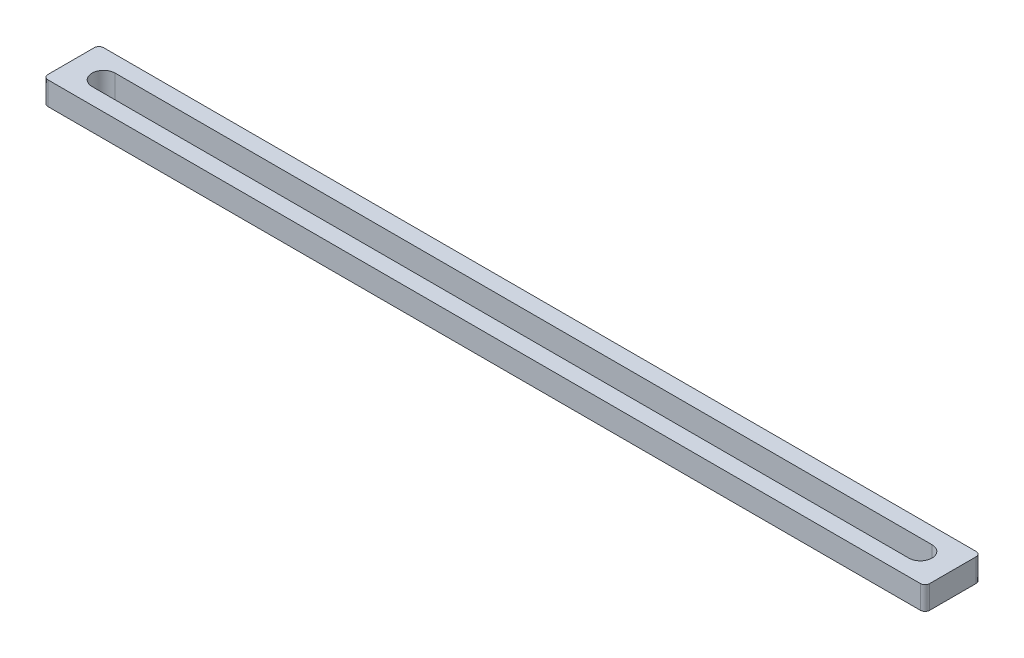
ISO-10303-21;
HEADER;
FILE_DESCRIPTION(('STEP AP214'),'2;1');
FILE_NAME('part.step','',(''),(''),'','','');
FILE_SCHEMA(('AUTOMOTIVE_DESIGN { 1 0 10303 214 1 1 1 1 }'));
ENDSEC;
DATA;
#1=APPLICATION_CONTEXT('core data for automotive mechanical design processes');
#2=APPLICATION_PROTOCOL_DEFINITION('international standard','automotive_design',2000,#1);
#3=PRODUCT_CONTEXT('',#1,'mechanical');
#4=PRODUCT('Part','Part','',(#3));
#5=PRODUCT_RELATED_PRODUCT_CATEGORY('part','',(#4));
#6=PRODUCT_DEFINITION_FORMATION('','',#4);
#7=PRODUCT_DEFINITION_CONTEXT('part definition',#1,'design');
#8=PRODUCT_DEFINITION('design','',#6,#7);
#9=PRODUCT_DEFINITION_SHAPE('','',#8);
#10=(LENGTH_UNIT() NAMED_UNIT(*) SI_UNIT(.MILLI.,.METRE.));
#11=(NAMED_UNIT(*) PLANE_ANGLE_UNIT() SI_UNIT($,.RADIAN.));
#12=(NAMED_UNIT(*) SI_UNIT($,.STERADIAN.) SOLID_ANGLE_UNIT());
#13=UNCERTAINTY_MEASURE_WITH_UNIT(LENGTH_MEASURE(1.E-05),#10,'distance_accuracy_value','');
#14=(GEOMETRIC_REPRESENTATION_CONTEXT(3) GLOBAL_UNCERTAINTY_ASSIGNED_CONTEXT((#13)) GLOBAL_UNIT_ASSIGNED_CONTEXT((#10,
#11,#12)) REPRESENTATION_CONTEXT('',''));
#15=CARTESIAN_POINT('',(0.,0.,0.));
#16=DIRECTION('',(0.,0.,1.));
#17=DIRECTION('',(1.,0.,0.));
#18=AXIS2_PLACEMENT_3D('',#15,#16,#17);
#19=CARTESIAN_POINT('',(0.,2.5,0.));
#20=DIRECTION('',(0.,-1.,0.));
#21=DIRECTION('',(0.,0.,-1.));
#22=AXIS2_PLACEMENT_3D('',#19,#20,#21);
#23=PLANE('',#22);
#24=DIRECTION('',(0.,0.,-1.));
#25=VECTOR('',#24,1.);
#26=CARTESIAN_POINT('',(95.,2.5,6.));
#27=LINE('',#26,#25);
#28=CARTESIAN_POINT('',(95.,2.5,5.));
#29=VERTEX_POINT('',#28);
#30=CARTESIAN_POINT('',(95.,2.5,-5.));
#31=VERTEX_POINT('',#30);
#32=EDGE_CURVE('E188',#29,#31,#27,.T.);
#33=ORIENTED_EDGE('',*,*,#32,.T.);
#34=CARTESIAN_POINT('',(94.,2.5,-5.));
#35=DIRECTION('',(0.,-1.,0.));
#36=DIRECTION('',(0.,0.,-1.));
#37=AXIS2_PLACEMENT_3D('',#34,#35,#36);
#38=CIRCLE('',#37,1.);
#39=CARTESIAN_POINT('',(94.,2.5,-6.));
#40=VERTEX_POINT('',#39);
#41=EDGE_CURVE('E250',#31,#40,#38,.F.);
#42=ORIENTED_EDGE('',*,*,#41,.T.);
#43=DIRECTION('',(-1.,0.,0.));
#44=VECTOR('',#43,1.);
#45=CARTESIAN_POINT('',(-95.,2.5,-6.));
#46=LINE('',#45,#44);
#47=CARTESIAN_POINT('',(-94.,2.5,-6.));
#48=VERTEX_POINT('',#47);
#49=EDGE_CURVE('E192',#40,#48,#46,.T.);
#50=ORIENTED_EDGE('',*,*,#49,.T.);
#51=CARTESIAN_POINT('',(-94.,2.5,-5.));
#52=DIRECTION('',(0.,-1.,0.));
#53=DIRECTION('',(0.,0.,-1.));
#54=AXIS2_PLACEMENT_3D('',#51,#52,#53);
#55=CIRCLE('',#54,1.);
#56=CARTESIAN_POINT('',(-95.,2.5,-5.));
#57=VERTEX_POINT('',#56);
#58=EDGE_CURVE('E242',#48,#57,#55,.F.);
#59=ORIENTED_EDGE('',*,*,#58,.T.);
#60=DIRECTION('',(0.,0.,1.));
#61=VECTOR('',#60,1.);
#62=CARTESIAN_POINT('',(-95.,2.5,6.));
#63=LINE('',#62,#61);
#64=CARTESIAN_POINT('',(-95.,2.5,5.));
#65=VERTEX_POINT('',#64);
#66=EDGE_CURVE('E197',#57,#65,#63,.T.);
#67=ORIENTED_EDGE('',*,*,#66,.T.);
#68=CARTESIAN_POINT('',(-94.,2.5,5.));
#69=DIRECTION('',(0.,-1.,0.));
#70=DIRECTION('',(0.,0.,-1.));
#71=AXIS2_PLACEMENT_3D('',#68,#69,#70);
#72=CIRCLE('',#71,1.);
#73=CARTESIAN_POINT('',(-94.,2.5,6.));
#74=VERTEX_POINT('',#73);
#75=EDGE_CURVE('E66',#65,#74,#72,.F.);
#76=ORIENTED_EDGE('',*,*,#75,.T.);
#77=DIRECTION('',(1.,0.,0.));
#78=VECTOR('',#77,1.);
#79=CARTESIAN_POINT('',(-95.,2.5,6.));
#80=LINE('',#79,#78);
#81=CARTESIAN_POINT('',(94.,2.5,6.));
#82=VERTEX_POINT('',#81);
#83=EDGE_CURVE('E200',#74,#82,#80,.T.);
#84=ORIENTED_EDGE('',*,*,#83,.T.);
#85=CARTESIAN_POINT('',(94.,2.5,5.));
#86=DIRECTION('',(0.,-1.,0.));
#87=DIRECTION('',(0.,0.,-1.));
#88=AXIS2_PLACEMENT_3D('',#85,#86,#87);
#89=CIRCLE('',#88,1.);
#90=EDGE_CURVE('E247',#82,#29,#89,.F.);
#91=ORIENTED_EDGE('',*,*,#90,.T.);
#92=EDGE_LOOP('',(#33,#42,#50,#59,#67,#76,#84,#91));
#93=FACE_BOUND('',#92,.T.);
#94=CARTESIAN_POINT('',(-88.,2.5,0.));
#95=DIRECTION('',(0.,1.,0.));
#96=DIRECTION('',(0.,0.,1.));
#97=AXIS2_PLACEMENT_3D('',#94,#95,#96);
#98=CIRCLE('',#97,2.5);
#99=CARTESIAN_POINT('',(-88.,2.5,-2.5));
#100=VERTEX_POINT('',#99);
#101=CARTESIAN_POINT('',(-88.,2.5,2.5));
#102=VERTEX_POINT('',#101);
#103=EDGE_CURVE('E135',#100,#102,#98,.T.);
#104=ORIENTED_EDGE('',*,*,#103,.F.);
#105=DIRECTION('',(-1.,0.,0.));
#106=VECTOR('',#105,1.);
#107=CARTESIAN_POINT('',(-88.,2.5,-2.5));
#108=LINE('',#107,#106);
#109=CARTESIAN_POINT('',(88.,2.5,-2.5));
#110=VERTEX_POINT('',#109);
#111=EDGE_CURVE('E164',#110,#100,#108,.T.);
#112=ORIENTED_EDGE('',*,*,#111,.F.);
#113=CARTESIAN_POINT('',(88.,2.5,0.));
#114=DIRECTION('',(0.,1.,0.));
#115=DIRECTION('',(0.,0.,1.));
#116=AXIS2_PLACEMENT_3D('',#113,#114,#115);
#117=CIRCLE('',#116,2.5);
#118=CARTESIAN_POINT('',(88.,2.5,2.5));
#119=VERTEX_POINT('',#118);
#120=EDGE_CURVE('E160',#119,#110,#117,.T.);
#121=ORIENTED_EDGE('',*,*,#120,.F.);
#122=DIRECTION('',(1.,0.,0.));
#123=VECTOR('',#122,1.);
#124=CARTESIAN_POINT('',(-88.,2.5,2.5));
#125=LINE('',#124,#123);
#126=EDGE_CURVE('E146',#102,#119,#125,.T.);
#127=ORIENTED_EDGE('',*,*,#126,.F.);
#128=EDGE_LOOP('',(#104,#112,#121,#127));
#129=FACE_BOUND('',#128,.T.);
#130=ADVANCED_FACE('F43',(#93,#129),#23,.F.);
#131=CARTESIAN_POINT('',(0.,-2.5,0.));
#132=DIRECTION('',(0.,-1.,0.));
#133=DIRECTION('',(0.,0.,-1.));
#134=AXIS2_PLACEMENT_3D('',#131,#132,#133);
#135=PLANE('',#134);
#136=DIRECTION('',(-1.,0.,0.));
#137=VECTOR('',#136,1.);
#138=CARTESIAN_POINT('',(-95.,-2.5,-6.));
#139=LINE('',#138,#137);
#140=CARTESIAN_POINT('',(94.,-2.5,-6.));
#141=VERTEX_POINT('',#140);
#142=CARTESIAN_POINT('',(-94.,-2.5,-6.));
#143=VERTEX_POINT('',#142);
#144=EDGE_CURVE('E207',#141,#143,#139,.T.);
#145=ORIENTED_EDGE('',*,*,#144,.F.);
#146=CARTESIAN_POINT('',(94.,-2.5,-5.));
#147=DIRECTION('',(0.,-1.,0.));
#148=DIRECTION('',(0.,0.,-1.));
#149=AXIS2_PLACEMENT_3D('',#146,#147,#148);
#150=CIRCLE('',#149,1.);
#151=CARTESIAN_POINT('',(95.,-2.5,-5.));
#152=VERTEX_POINT('',#151);
#153=EDGE_CURVE('E232',#141,#152,#150,.T.);
#154=ORIENTED_EDGE('',*,*,#153,.T.);
#155=DIRECTION('',(0.,0.,-1.));
#156=VECTOR('',#155,1.);
#157=CARTESIAN_POINT('',(95.,-2.5,6.));
#158=LINE('',#157,#156);
#159=CARTESIAN_POINT('',(95.,-2.5,5.));
#160=VERTEX_POINT('',#159);
#161=EDGE_CURVE('E155',#160,#152,#158,.T.);
#162=ORIENTED_EDGE('',*,*,#161,.F.);
#163=CARTESIAN_POINT('',(94.,-2.5,5.));
#164=DIRECTION('',(0.,-1.,0.));
#165=DIRECTION('',(0.,0.,-1.));
#166=AXIS2_PLACEMENT_3D('',#163,#164,#165);
#167=CIRCLE('',#166,1.);
#168=CARTESIAN_POINT('',(94.,-2.5,6.));
#169=VERTEX_POINT('',#168);
#170=EDGE_CURVE('E229',#160,#169,#167,.T.);
#171=ORIENTED_EDGE('',*,*,#170,.T.);
#172=DIRECTION('',(1.,0.,0.));
#173=VECTOR('',#172,1.);
#174=CARTESIAN_POINT('',(-95.,-2.5,6.));
#175=LINE('',#174,#173);
#176=CARTESIAN_POINT('',(-94.,-2.5,6.));
#177=VERTEX_POINT('',#176);
#178=EDGE_CURVE('E193',#177,#169,#175,.T.);
#179=ORIENTED_EDGE('',*,*,#178,.F.);
#180=CARTESIAN_POINT('',(-94.,-2.5,5.));
#181=DIRECTION('',(0.,-1.,0.));
#182=DIRECTION('',(0.,0.,-1.));
#183=AXIS2_PLACEMENT_3D('',#180,#181,#182);
#184=CIRCLE('',#183,1.);
#185=CARTESIAN_POINT('',(-95.,-2.5,5.));
#186=VERTEX_POINT('',#185);
#187=EDGE_CURVE('E226',#177,#186,#184,.T.);
#188=ORIENTED_EDGE('',*,*,#187,.T.);
#189=DIRECTION('',(0.,0.,1.));
#190=VECTOR('',#189,1.);
#191=CARTESIAN_POINT('',(-95.,-2.5,6.));
#192=LINE('',#191,#190);
#193=CARTESIAN_POINT('',(-95.,-2.5,-5.));
#194=VERTEX_POINT('',#193);
#195=EDGE_CURVE('E211',#194,#186,#192,.T.);
#196=ORIENTED_EDGE('',*,*,#195,.F.);
#197=CARTESIAN_POINT('',(-94.,-2.5,-5.));
#198=DIRECTION('',(0.,-1.,0.));
#199=DIRECTION('',(0.,0.,-1.));
#200=AXIS2_PLACEMENT_3D('',#197,#198,#199);
#201=CIRCLE('',#200,1.);
#202=EDGE_CURVE('E223',#194,#143,#201,.T.);
#203=ORIENTED_EDGE('',*,*,#202,.T.);
#204=EDGE_LOOP('',(#145,#154,#162,#171,#179,#188,#196,#203));
#205=FACE_BOUND('',#204,.T.);
#206=DIRECTION('',(-1.,0.,0.));
#207=VECTOR('',#206,1.);
#208=CARTESIAN_POINT('',(-88.,-2.5,-2.5));
#209=LINE('',#208,#207);
#210=CARTESIAN_POINT('',(88.,-2.5,-2.5));
#211=VERTEX_POINT('',#210);
#212=CARTESIAN_POINT('',(-88.,-2.5,-2.5));
#213=VERTEX_POINT('',#212);
#214=EDGE_CURVE('E147',#211,#213,#209,.T.);
#215=ORIENTED_EDGE('',*,*,#214,.T.);
#216=CARTESIAN_POINT('',(-88.,-2.5,0.));
#217=DIRECTION('',(0.,1.,0.));
#218=DIRECTION('',(0.,0.,1.));
#219=AXIS2_PLACEMENT_3D('',#216,#217,#218);
#220=CIRCLE('',#219,2.5);
#221=CARTESIAN_POINT('',(-88.,-2.5,2.5));
#222=VERTEX_POINT('',#221);
#223=EDGE_CURVE('E169',#213,#222,#220,.T.);
#224=ORIENTED_EDGE('',*,*,#223,.T.);
#225=DIRECTION('',(1.,0.,0.));
#226=VECTOR('',#225,1.);
#227=CARTESIAN_POINT('',(-88.,-2.5,2.5));
#228=LINE('',#227,#226);
#229=CARTESIAN_POINT('',(88.,-2.5,2.5));
#230=VERTEX_POINT('',#229);
#231=EDGE_CURVE('E153',#222,#230,#228,.T.);
#232=ORIENTED_EDGE('',*,*,#231,.T.);
#233=CARTESIAN_POINT('',(88.,-2.5,0.));
#234=DIRECTION('',(0.,1.,0.));
#235=DIRECTION('',(0.,0.,1.));
#236=AXIS2_PLACEMENT_3D('',#233,#234,#235);
#237=CIRCLE('',#236,2.5);
#238=EDGE_CURVE('E174',#230,#211,#237,.T.);
#239=ORIENTED_EDGE('',*,*,#238,.T.);
#240=EDGE_LOOP('',(#215,#224,#232,#239));
#241=FACE_BOUND('',#240,.T.);
#242=ADVANCED_FACE('F270',(#205,#241),#135,.T.);
#243=CARTESIAN_POINT('',(95.,2.5,6.));
#244=DIRECTION('',(-1.,0.,0.));
#245=DIRECTION('',(0.,0.,1.));
#246=AXIS2_PLACEMENT_3D('',#243,#244,#245);
#247=PLANE('',#246);
#248=ORIENTED_EDGE('',*,*,#161,.T.);
#249=DIRECTION('',(0.,-1.,0.));
#250=VECTOR('',#249,1.);
#251=CARTESIAN_POINT('',(95.,2.5,-5.));
#252=LINE('',#251,#250);
#253=EDGE_CURVE('E239',#152,#31,#252,.F.);
#254=ORIENTED_EDGE('',*,*,#253,.T.);
#255=ORIENTED_EDGE('',*,*,#32,.F.);
#256=DIRECTION('',(0.,-1.,0.));
#257=VECTOR('',#256,1.);
#258=CARTESIAN_POINT('',(95.,2.5,5.));
#259=LINE('',#258,#257);
#260=EDGE_CURVE('E235',#29,#160,#259,.T.);
#261=ORIENTED_EDGE('',*,*,#260,.T.);
#262=EDGE_LOOP('',(#248,#254,#255,#261));
#263=FACE_BOUND('',#262,.T.);
#264=ADVANCED_FACE('F284',(#263),#247,.F.);
#265=CARTESIAN_POINT('',(-95.,2.5,-6.));
#266=DIRECTION('',(0.,0.,1.));
#267=DIRECTION('',(1.,0.,0.));
#268=AXIS2_PLACEMENT_3D('',#265,#266,#267);
#269=PLANE('',#268);
#270=ORIENTED_EDGE('',*,*,#49,.F.);
#271=DIRECTION('',(0.,-1.,0.));
#272=VECTOR('',#271,1.);
#273=CARTESIAN_POINT('',(94.,2.5,-6.));
#274=LINE('',#273,#272);
#275=EDGE_CURVE('E219',#40,#141,#274,.T.);
#276=ORIENTED_EDGE('',*,*,#275,.T.);
#277=ORIENTED_EDGE('',*,*,#144,.T.);
#278=DIRECTION('',(0.,-1.,0.));
#279=VECTOR('',#278,1.);
#280=CARTESIAN_POINT('',(-94.,2.5,-6.));
#281=LINE('',#280,#279);
#282=EDGE_CURVE('E203',#143,#48,#281,.F.);
#283=ORIENTED_EDGE('',*,*,#282,.T.);
#284=EDGE_LOOP('',(#270,#276,#277,#283));
#285=FACE_BOUND('',#284,.T.);
#286=ADVANCED_FACE('F292',(#285),#269,.F.);
#287=CARTESIAN_POINT('',(-95.,2.5,6.));
#288=DIRECTION('',(1.,0.,0.));
#289=DIRECTION('',(0.,0.,-1.));
#290=AXIS2_PLACEMENT_3D('',#287,#288,#289);
#291=PLANE('',#290);
#292=ORIENTED_EDGE('',*,*,#195,.T.);
#293=DIRECTION('',(0.,-1.,0.));
#294=VECTOR('',#293,1.);
#295=CARTESIAN_POINT('',(-95.,2.5,5.));
#296=LINE('',#295,#294);
#297=EDGE_CURVE('E11',#186,#65,#296,.F.);
#298=ORIENTED_EDGE('',*,*,#297,.T.);
#299=ORIENTED_EDGE('',*,*,#66,.F.);
#300=DIRECTION('',(0.,-1.,0.));
#301=VECTOR('',#300,1.);
#302=CARTESIAN_POINT('',(-95.,2.5,-5.));
#303=LINE('',#302,#301);
#304=EDGE_CURVE('E52',#57,#194,#303,.T.);
#305=ORIENTED_EDGE('',*,*,#304,.T.);
#306=EDGE_LOOP('',(#292,#298,#299,#305));
#307=FACE_BOUND('',#306,.T.);
#308=ADVANCED_FACE('F264',(#307),#291,.F.);
#309=CARTESIAN_POINT('',(-95.,2.5,6.));
#310=DIRECTION('',(0.,0.,-1.));
#311=DIRECTION('',(-1.,0.,0.));
#312=AXIS2_PLACEMENT_3D('',#309,#310,#311);
#313=PLANE('',#312);
#314=ORIENTED_EDGE('',*,*,#178,.T.);
#315=DIRECTION('',(0.,-1.,0.));
#316=VECTOR('',#315,1.);
#317=CARTESIAN_POINT('',(94.,2.5,6.));
#318=LINE('',#317,#316);
#319=EDGE_CURVE('E59',#169,#82,#318,.F.);
#320=ORIENTED_EDGE('',*,*,#319,.T.);
#321=ORIENTED_EDGE('',*,*,#83,.F.);
#322=DIRECTION('',(0.,-1.,0.));
#323=VECTOR('',#322,1.);
#324=CARTESIAN_POINT('',(-94.,2.5,6.));
#325=LINE('',#324,#323);
#326=EDGE_CURVE('E253',#74,#177,#325,.T.);
#327=ORIENTED_EDGE('',*,*,#326,.T.);
#328=EDGE_LOOP('',(#314,#320,#321,#327));
#329=FACE_BOUND('',#328,.T.);
#330=ADVANCED_FACE('F276',(#329),#313,.F.);
#331=CARTESIAN_POINT('',(-88.,2.5,0.));
#332=DIRECTION('',(0.,-1.,0.));
#333=DIRECTION('',(0.,0.,-1.));
#334=AXIS2_PLACEMENT_3D('',#331,#332,#333);
#335=CYLINDRICAL_SURFACE('',#334,2.5);
#336=ORIENTED_EDGE('',*,*,#223,.F.);
#337=DIRECTION('',(0.,-1.,0.));
#338=VECTOR('',#337,1.);
#339=CARTESIAN_POINT('',(-88.,2.5,-2.5));
#340=LINE('',#339,#338);
#341=EDGE_CURVE('E141',#100,#213,#340,.T.);
#342=ORIENTED_EDGE('',*,*,#341,.F.);
#343=ORIENTED_EDGE('',*,*,#103,.T.);
#344=DIRECTION('',(0.,-1.,0.));
#345=VECTOR('',#344,1.);
#346=CARTESIAN_POINT('',(-88.,2.5,2.5));
#347=LINE('',#346,#345);
#348=EDGE_CURVE('E138',#102,#222,#347,.T.);
#349=ORIENTED_EDGE('',*,*,#348,.T.);
#350=EDGE_LOOP('',(#336,#342,#343,#349));
#351=FACE_BOUND('',#350,.T.);
#352=ADVANCED_FACE('F137',(#351),#335,.F.);
#353=CARTESIAN_POINT('',(-88.,2.5,2.5));
#354=DIRECTION('',(0.,0.,-1.));
#355=DIRECTION('',(-1.,0.,0.));
#356=AXIS2_PLACEMENT_3D('',#353,#354,#355);
#357=PLANE('',#356);
#358=ORIENTED_EDGE('',*,*,#231,.F.);
#359=ORIENTED_EDGE('',*,*,#348,.F.);
#360=ORIENTED_EDGE('',*,*,#126,.T.);
#361=DIRECTION('',(0.,-1.,0.));
#362=VECTOR('',#361,1.);
#363=CARTESIAN_POINT('',(88.,2.5,2.5));
#364=LINE('',#363,#362);
#365=EDGE_CURVE('E156',#119,#230,#364,.T.);
#366=ORIENTED_EDGE('',*,*,#365,.T.);
#367=EDGE_LOOP('',(#358,#359,#360,#366));
#368=FACE_BOUND('',#367,.T.);
#369=ADVANCED_FACE('F150',(#368),#357,.T.);
#370=CARTESIAN_POINT('',(88.,2.5,0.));
#371=DIRECTION('',(0.,-1.,0.));
#372=DIRECTION('',(0.,0.,-1.));
#373=AXIS2_PLACEMENT_3D('',#370,#371,#372);
#374=CYLINDRICAL_SURFACE('',#373,2.5);
#375=ORIENTED_EDGE('',*,*,#238,.F.);
#376=ORIENTED_EDGE('',*,*,#365,.F.);
#377=ORIENTED_EDGE('',*,*,#120,.T.);
#378=DIRECTION('',(0.,-1.,0.));
#379=VECTOR('',#378,1.);
#380=CARTESIAN_POINT('',(88.,2.5,-2.5));
#381=LINE('',#380,#379);
#382=EDGE_CURVE('E183',#110,#211,#381,.T.);
#383=ORIENTED_EDGE('',*,*,#382,.T.);
#384=EDGE_LOOP('',(#375,#376,#377,#383));
#385=FACE_BOUND('',#384,.T.);
#386=ADVANCED_FACE('F353',(#385),#374,.F.);
#387=CARTESIAN_POINT('',(-88.,2.5,-2.5));
#388=DIRECTION('',(0.,0.,1.));
#389=DIRECTION('',(1.,0.,0.));
#390=AXIS2_PLACEMENT_3D('',#387,#388,#389);
#391=PLANE('',#390);
#392=ORIENTED_EDGE('',*,*,#214,.F.);
#393=ORIENTED_EDGE('',*,*,#382,.F.);
#394=ORIENTED_EDGE('',*,*,#111,.T.);
#395=ORIENTED_EDGE('',*,*,#341,.T.);
#396=EDGE_LOOP('',(#392,#393,#394,#395));
#397=FACE_BOUND('',#396,.T.);
#398=ADVANCED_FACE('F317',(#397),#391,.T.);
#399=CARTESIAN_POINT('',(94.,2.5,-5.));
#400=DIRECTION('',(0.,-1.,0.));
#401=DIRECTION('',(0.,0.,-1.));
#402=AXIS2_PLACEMENT_3D('',#399,#400,#401);
#403=CYLINDRICAL_SURFACE('',#402,1.);
#404=ORIENTED_EDGE('',*,*,#41,.F.);
#405=ORIENTED_EDGE('',*,*,#253,.F.);
#406=ORIENTED_EDGE('',*,*,#153,.F.);
#407=ORIENTED_EDGE('',*,*,#275,.F.);
#408=EDGE_LOOP('',(#404,#405,#406,#407));
#409=FACE_BOUND('',#408,.T.);
#410=ADVANCED_FACE('F289',(#409),#403,.T.);
#411=CARTESIAN_POINT('',(94.,2.5,5.));
#412=DIRECTION('',(0.,-1.,0.));
#413=DIRECTION('',(0.,0.,-1.));
#414=AXIS2_PLACEMENT_3D('',#411,#412,#413);
#415=CYLINDRICAL_SURFACE('',#414,1.);
#416=ORIENTED_EDGE('',*,*,#90,.F.);
#417=ORIENTED_EDGE('',*,*,#319,.F.);
#418=ORIENTED_EDGE('',*,*,#170,.F.);
#419=ORIENTED_EDGE('',*,*,#260,.F.);
#420=EDGE_LOOP('',(#416,#417,#418,#419));
#421=FACE_BOUND('',#420,.T.);
#422=ADVANCED_FACE('F281',(#421),#415,.T.);
#423=CARTESIAN_POINT('',(-94.,2.5,5.));
#424=DIRECTION('',(0.,-1.,0.));
#425=DIRECTION('',(0.,0.,-1.));
#426=AXIS2_PLACEMENT_3D('',#423,#424,#425);
#427=CYLINDRICAL_SURFACE('',#426,1.);
#428=ORIENTED_EDGE('',*,*,#75,.F.);
#429=ORIENTED_EDGE('',*,*,#297,.F.);
#430=ORIENTED_EDGE('',*,*,#187,.F.);
#431=ORIENTED_EDGE('',*,*,#326,.F.);
#432=EDGE_LOOP('',(#428,#429,#430,#431));
#433=FACE_BOUND('',#432,.T.);
#434=ADVANCED_FACE('F275',(#433),#427,.T.);
#435=CARTESIAN_POINT('',(-94.,2.5,-5.));
#436=DIRECTION('',(0.,-1.,0.));
#437=DIRECTION('',(0.,0.,-1.));
#438=AXIS2_PLACEMENT_3D('',#435,#436,#437);
#439=CYLINDRICAL_SURFACE('',#438,1.);
#440=ORIENTED_EDGE('',*,*,#58,.F.);
#441=ORIENTED_EDGE('',*,*,#282,.F.);
#442=ORIENTED_EDGE('',*,*,#202,.F.);
#443=ORIENTED_EDGE('',*,*,#304,.F.);
#444=EDGE_LOOP('',(#440,#441,#442,#443));
#445=FACE_BOUND('',#444,.T.);
#446=ADVANCED_FACE('F45',(#445),#439,.T.);
#447=CLOSED_SHELL('',(#130,#242,#264,#286,#308,#330,#352,#369,#386,#398,#410,#422,#434,#446));
#448=MANIFOLD_SOLID_BREP('B2',#447);
#449=ADVANCED_BREP_SHAPE_REPRESENTATION('',(#18,#448),#14);
#450=SHAPE_DEFINITION_REPRESENTATION(#9,#449);
ENDSEC;
END-ISO-10303-21;
